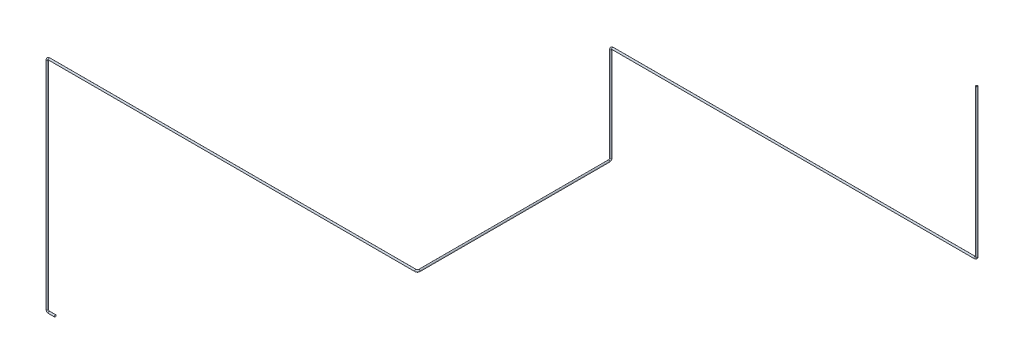
ISO-10303-21;
HEADER;
FILE_DESCRIPTION(('STEP AP214'),'2;1');
FILE_NAME('part.step','',(''),(''),'','','');
FILE_SCHEMA(('AUTOMOTIVE_DESIGN { 1 0 10303 214 1 1 1 1 }'));
ENDSEC;
DATA;
#1=APPLICATION_CONTEXT('core data for automotive mechanical design processes');
#2=APPLICATION_PROTOCOL_DEFINITION('international standard','automotive_design',2000,#1);
#3=PRODUCT_CONTEXT('',#1,'mechanical');
#4=PRODUCT('Part','Part','',(#3));
#5=PRODUCT_RELATED_PRODUCT_CATEGORY('part','',(#4));
#6=PRODUCT_DEFINITION_FORMATION('','',#4);
#7=PRODUCT_DEFINITION_CONTEXT('part definition',#1,'design');
#8=PRODUCT_DEFINITION('design','',#6,#7);
#9=PRODUCT_DEFINITION_SHAPE('','',#8);
#10=(LENGTH_UNIT() NAMED_UNIT(*) SI_UNIT(.MILLI.,.METRE.));
#11=(NAMED_UNIT(*) PLANE_ANGLE_UNIT() SI_UNIT($,.RADIAN.));
#12=(NAMED_UNIT(*) SI_UNIT($,.STERADIAN.) SOLID_ANGLE_UNIT());
#13=UNCERTAINTY_MEASURE_WITH_UNIT(LENGTH_MEASURE(1.E-05),#10,'distance_accuracy_value','');
#14=(GEOMETRIC_REPRESENTATION_CONTEXT(3) GLOBAL_UNCERTAINTY_ASSIGNED_CONTEXT((#13)) GLOBAL_UNIT_ASSIGNED_CONTEXT((#10,
#11,#12)) REPRESENTATION_CONTEXT('',''));
#15=CARTESIAN_POINT('',(0.,0.,0.));
#16=DIRECTION('',(0.,0.,1.));
#17=DIRECTION('',(1.,0.,0.));
#18=AXIS2_PLACEMENT_3D('',#15,#16,#17);
#19=CARTESIAN_POINT('',(-21783.3112637115,-6172.59943165804,38950.2492567144));
#20=DIRECTION('',(0.,1.,0.));
#21=DIRECTION('',(1.,0.,0.));
#22=AXIS2_PLACEMENT_3D('',#19,#20,#21);
#23=PLANE('',#22);
#24=CARTESIAN_POINT('',(-21783.3112637115,-6172.59943165804,38950.2492567144));
#25=DIRECTION('',(0.,1.,0.));
#26=DIRECTION('',(0.,0.,1.));
#27=AXIS2_PLACEMENT_3D('',#24,#25,#26);
#28=CIRCLE('',#27,14.0000000000006);
#29=CARTESIAN_POINT('',(-21783.3112637115,-6172.59943165804,38964.2492567144));
#30=VERTEX_POINT('',#29);
#31=EDGE_CURVE('E100',#30,#30,#28,.T.);
#32=ORIENTED_EDGE('',*,*,#31,.F.);
#33=EDGE_LOOP('',(#32));
#34=FACE_BOUND('',#33,.T.);
#35=CARTESIAN_POINT('',(-21783.3112637115,-6172.59943165804,38950.2492567144));
#36=DIRECTION('',(0.,1.,0.));
#37=DIRECTION('',(1.,0.,0.));
#38=AXIS2_PLACEMENT_3D('',#35,#36,#37);
#39=CIRCLE('',#38,15.0000000000006);
#40=CARTESIAN_POINT('',(-21768.3112637115,-6172.59943165804,38950.2492567144));
#41=VERTEX_POINT('',#40);
#42=EDGE_CURVE('E93',#41,#41,#39,.T.);
#43=ORIENTED_EDGE('',*,*,#42,.T.);
#44=EDGE_LOOP('',(#43));
#45=FACE_BOUND('',#44,.T.);
#46=ADVANCED_FACE('F47',(#34,#45),#23,.T.);
#47=CARTESIAN_POINT('',(-33723.2648506242,-13822.0136339342,42121.7001960568));
#48=DIRECTION('',(-1.,0.,0.));
#49=DIRECTION('',(0.,0.,1.));
#50=AXIS2_PLACEMENT_3D('',#47,#48,#49);
#51=PLANE('',#50);
#52=CARTESIAN_POINT('',(-33723.2648506242,-13822.0136339342,42121.7001960568));
#53=DIRECTION('',(-1.,0.,0.));
#54=DIRECTION('',(0.,0.,1.));
#55=AXIS2_PLACEMENT_3D('',#52,#53,#54);
#56=CIRCLE('',#55,14.0000000000006);
#57=CARTESIAN_POINT('',(-33723.2648506242,-13822.0136339342,42135.7001960568));
#58=VERTEX_POINT('',#57);
#59=EDGE_CURVE('E96',#58,#58,#56,.T.);
#60=ORIENTED_EDGE('',*,*,#59,.T.);
#61=EDGE_LOOP('',(#60));
#62=FACE_BOUND('',#61,.T.);
#63=CARTESIAN_POINT('',(-33723.2648506242,-13822.0136339342,42121.7001960568));
#64=DIRECTION('',(-1.,0.,0.));
#65=DIRECTION('',(0.,0.,1.));
#66=AXIS2_PLACEMENT_3D('',#63,#64,#65);
#67=CIRCLE('',#66,15.0000000000006);
#68=CARTESIAN_POINT('',(-33723.2648506242,-13822.0136339342,42136.7001960568));
#69=VERTEX_POINT('',#68);
#70=EDGE_CURVE('E11',#69,#69,#67,.T.);
#71=ORIENTED_EDGE('',*,*,#70,.F.);
#72=EDGE_LOOP('',(#71));
#73=FACE_BOUND('',#72,.T.);
#74=ADVANCED_FACE('F150',(#62,#73),#51,.F.);
#75=CARTESIAN_POINT('',(-21783.3112637115,-6172.59943165804,38950.2492567144));
#76=DIRECTION('',(0.,-1.,0.));
#77=DIRECTION('',(0.,0.,-1.));
#78=AXIS2_PLACEMENT_3D('',#75,#76,#77);
#79=CYLINDRICAL_SURFACE('',#78,15.0000000000006);
#80=CARTESIAN_POINT('',(-21783.3112637115,-8593.92082381698,38950.2492567144));
#81=DIRECTION('',(0.,1.,0.));
#82=DIRECTION('',(1.,0.,0.));
#83=AXIS2_PLACEMENT_3D('',#80,#81,#82);
#84=CIRCLE('',#83,15.0000000000006);
#85=CARTESIAN_POINT('',(-21768.3112637115,-8593.92082381698,38950.2492567144));
#86=VERTEX_POINT('',#85);
#87=EDGE_CURVE('E90',#86,#86,#84,.T.);
#88=ORIENTED_EDGE('',*,*,#87,.T.);
#89=EDGE_LOOP('',(#88));
#90=FACE_BOUND('',#89,.T.);
#91=ORIENTED_EDGE('',*,*,#42,.F.);
#92=EDGE_LOOP('',(#91));
#93=FACE_BOUND('',#92,.T.);
#94=ADVANCED_FACE('F154',(#90,#93),#79,.T.);
#95=CARTESIAN_POINT('',(-21813.3112637115,-8593.92082381698,38950.2492567144));
#96=DIRECTION('',(0.,0.,-1.));
#97=DIRECTION('',(-1.,0.,0.));
#98=AXIS2_PLACEMENT_3D('',#95,#96,#97);
#99=TOROIDAL_SURFACE('',#98,30.0000000000011,15.0000000000006);
#100=CARTESIAN_POINT('',(-21813.3112637115,-8623.92082381698,38950.2492567144));
#101=DIRECTION('',(1.,0.,0.));
#102=DIRECTION('',(0.,-1.,0.));
#103=AXIS2_PLACEMENT_3D('',#100,#101,#102);
#104=CIRCLE('',#103,15.0000000000006);
#105=CARTESIAN_POINT('',(-21813.3112637115,-8638.92082381698,38950.2492567144));
#106=VERTEX_POINT('',#105);
#107=EDGE_CURVE('E87',#106,#106,#104,.T.);
#108=CARTESIAN_POINT('',(-21813.3112637115,-8593.92082381698,38950.2492567144));
#109=DIRECTION('',(0.,0.,-1.));
#110=DIRECTION('',(-1.,0.,0.));
#111=AXIS2_PLACEMENT_3D('',#108,#109,#110);
#112=CIRCLE('',#111,45.0000000000017);
#113=EDGE_CURVE('',#86,#106,#112,.T.);
#114=ORIENTED_EDGE('',*,*,#87,.F.);
#115=ORIENTED_EDGE('',*,*,#107,.T.);
#116=ORIENTED_EDGE('',*,*,#113,.T.);
#117=ORIENTED_EDGE('',*,*,#113,.F.);
#118=EDGE_LOOP('',(#114,#116,#115,#117));
#119=FACE_BOUND('',#118,.T.);
#120=ADVANCED_FACE('F156',(#119),#99,.T.);
#121=CARTESIAN_POINT('',(-21813.3112637115,-8623.92082381698,38950.2492567144));
#122=DIRECTION('',(-1.,0.,0.));
#123=DIRECTION('',(0.,0.,1.));
#124=AXIS2_PLACEMENT_3D('',#121,#122,#123);
#125=CYLINDRICAL_SURFACE('',#124,15.0000000000006);
#126=CARTESIAN_POINT('',(-27753.5298397896,-8623.92082381698,38950.2492567144));
#127=DIRECTION('',(1.,0.,0.));
#128=DIRECTION('',(0.,-1.,0.));
#129=AXIS2_PLACEMENT_3D('',#126,#127,#128);
#130=CIRCLE('',#129,15.0000000000006);
#131=CARTESIAN_POINT('',(-27753.5298397896,-8608.92082381698,38950.2492567144));
#132=VERTEX_POINT('',#131);
#133=EDGE_CURVE('E84',#132,#132,#130,.T.);
#134=ORIENTED_EDGE('',*,*,#133,.T.);
#135=EDGE_LOOP('',(#134));
#136=FACE_BOUND('',#135,.T.);
#137=ORIENTED_EDGE('',*,*,#107,.F.);
#138=EDGE_LOOP('',(#137));
#139=FACE_BOUND('',#138,.T.);
#140=ADVANCED_FACE('F163',(#136,#139),#125,.T.);
#141=CARTESIAN_POINT('',(-27753.5298397896,-8653.92082381698,38950.2492567144));
#142=DIRECTION('',(0.,0.,1.));
#143=DIRECTION('',(1.,0.,0.));
#144=AXIS2_PLACEMENT_3D('',#141,#142,#143);
#145=TOROIDAL_SURFACE('',#144,29.9999999999958,15.0000000000006);
#146=CARTESIAN_POINT('',(-27783.5298397896,-8653.92082381697,38950.2492567144));
#147=DIRECTION('',(0.,1.,0.));
#148=DIRECTION('',(1.,0.,0.));
#149=AXIS2_PLACEMENT_3D('',#146,#147,#148);
#150=CIRCLE('',#149,15.0000000000006);
#151=CARTESIAN_POINT('',(-27798.5298397896,-8653.92082381697,38950.2492567144));
#152=VERTEX_POINT('',#151);
#153=EDGE_CURVE('E81',#152,#152,#150,.T.);
#154=CARTESIAN_POINT('',(-27753.5298397896,-8653.92082381698,38950.2492567144));
#155=DIRECTION('',(0.,0.,1.));
#156=DIRECTION('',(1.,0.,0.));
#157=AXIS2_PLACEMENT_3D('',#154,#155,#156);
#158=CIRCLE('',#157,44.9999999999964);
#159=EDGE_CURVE('',#132,#152,#158,.T.);
#160=ORIENTED_EDGE('',*,*,#133,.F.);
#161=ORIENTED_EDGE('',*,*,#153,.T.);
#162=ORIENTED_EDGE('',*,*,#159,.T.);
#163=ORIENTED_EDGE('',*,*,#159,.F.);
#164=EDGE_LOOP('',(#160,#162,#161,#163));
#165=FACE_BOUND('',#164,.T.);
#166=ADVANCED_FACE('F204',(#165),#145,.T.);
#167=CARTESIAN_POINT('',(-27783.5298397896,-8653.92082381697,38950.2492567144));
#168=DIRECTION('',(0.,-1.,0.));
#169=DIRECTION('',(0.,0.,-1.));
#170=AXIS2_PLACEMENT_3D('',#167,#168,#169);
#171=CYLINDRICAL_SURFACE('',#170,15.0000000000006);
#172=CARTESIAN_POINT('',(-27783.5298397896,-10192.4379230615,38950.2492567144));
#173=DIRECTION('',(0.,1.,0.));
#174=DIRECTION('',(1.,0.,0.));
#175=AXIS2_PLACEMENT_3D('',#172,#173,#174);
#176=CIRCLE('',#175,15.0000000000006);
#177=CARTESIAN_POINT('',(-27783.5298397896,-10192.4379230615,38935.2492567144));
#178=VERTEX_POINT('',#177);
#179=EDGE_CURVE('E78',#178,#178,#176,.T.);
#180=ORIENTED_EDGE('',*,*,#179,.T.);
#181=EDGE_LOOP('',(#180));
#182=FACE_BOUND('',#181,.T.);
#183=ORIENTED_EDGE('',*,*,#153,.F.);
#184=EDGE_LOOP('',(#183));
#185=FACE_BOUND('',#184,.T.);
#186=ADVANCED_FACE('F200',(#182,#185),#171,.T.);
#187=CARTESIAN_POINT('',(-27783.5298397896,-10192.4379230615,38980.2492567144));
#188=DIRECTION('',(-1.,0.,0.));
#189=DIRECTION('',(0.,0.,1.));
#190=AXIS2_PLACEMENT_3D('',#187,#188,#189);
#191=TOROIDAL_SURFACE('',#190,30.0000000000011,15.0000000000006);
#192=CARTESIAN_POINT('',(-27783.5298397896,-10222.4379230615,38980.2492567144));
#193=DIRECTION('',(0.,0.,-1.));
#194=DIRECTION('',(1.,0.,0.));
#195=AXIS2_PLACEMENT_3D('',#192,#193,#194);
#196=CIRCLE('',#195,15.0000000000006);
#197=CARTESIAN_POINT('',(-27783.5298397896,-10237.4379230615,38980.2492567144));
#198=VERTEX_POINT('',#197);
#199=EDGE_CURVE('E75',#198,#198,#196,.T.);
#200=CARTESIAN_POINT('',(-27783.5298397896,-10192.4379230615,38980.2492567144));
#201=DIRECTION('',(-1.,0.,0.));
#202=DIRECTION('',(0.,0.,1.));
#203=AXIS2_PLACEMENT_3D('',#200,#201,#202);
#204=CIRCLE('',#203,45.0000000000017);
#205=EDGE_CURVE('',#178,#198,#204,.T.);
#206=ORIENTED_EDGE('',*,*,#179,.F.);
#207=ORIENTED_EDGE('',*,*,#199,.T.);
#208=ORIENTED_EDGE('',*,*,#205,.T.);
#209=ORIENTED_EDGE('',*,*,#205,.F.);
#210=EDGE_LOOP('',(#206,#208,#207,#209));
#211=FACE_BOUND('',#210,.T.);
#212=ADVANCED_FACE('F196',(#211),#191,.T.);
#213=CARTESIAN_POINT('',(-27783.5298397896,-10222.4379230615,38980.2492567144));
#214=DIRECTION('',(0.,0.,1.));
#215=DIRECTION('',(1.,0.,0.));
#216=AXIS2_PLACEMENT_3D('',#213,#214,#215);
#217=CYLINDRICAL_SURFACE('',#216,15.0000000000006);
#218=CARTESIAN_POINT('',(-27783.5298397896,-10222.4379230615,42091.7001960568));
#219=DIRECTION('',(0.,0.,-1.));
#220=DIRECTION('',(1.,0.,0.));
#221=AXIS2_PLACEMENT_3D('',#218,#219,#220);
#222=CIRCLE('',#221,15.0000000000006);
#223=CARTESIAN_POINT('',(-27768.5298397896,-10222.4379230615,42091.7001960568));
#224=VERTEX_POINT('',#223);
#225=EDGE_CURVE('E72',#224,#224,#222,.T.);
#226=ORIENTED_EDGE('',*,*,#225,.T.);
#227=EDGE_LOOP('',(#226));
#228=FACE_BOUND('',#227,.T.);
#229=ORIENTED_EDGE('',*,*,#199,.F.);
#230=EDGE_LOOP('',(#229));
#231=FACE_BOUND('',#230,.T.);
#232=ADVANCED_FACE('F192',(#228,#231),#217,.T.);
#233=CARTESIAN_POINT('',(-27813.5298397896,-10222.4379230615,42091.7001960568));
#234=DIRECTION('',(0.,-1.,0.));
#235=DIRECTION('',(0.,0.,-1.));
#236=AXIS2_PLACEMENT_3D('',#233,#234,#235);
#237=TOROIDAL_SURFACE('',#236,30.0000000000082,15.0000000000006);
#238=CARTESIAN_POINT('',(-27813.5298397896,-10222.4379230615,42121.7001960569));
#239=DIRECTION('',(1.,0.,0.));
#240=DIRECTION('',(0.,0.,1.));
#241=AXIS2_PLACEMENT_3D('',#238,#239,#240);
#242=CIRCLE('',#241,15.0000000000006);
#243=CARTESIAN_POINT('',(-27813.5298397896,-10222.4379230615,42136.7001960569));
#244=VERTEX_POINT('',#243);
#245=EDGE_CURVE('E69',#244,#244,#242,.T.);
#246=CARTESIAN_POINT('',(-27813.5298397896,-10222.4379230615,42091.7001960568));
#247=DIRECTION('',(0.,-1.,0.));
#248=DIRECTION('',(0.,0.,-1.));
#249=AXIS2_PLACEMENT_3D('',#246,#247,#248);
#250=CIRCLE('',#249,45.0000000000088);
#251=EDGE_CURVE('',#224,#244,#250,.T.);
#252=ORIENTED_EDGE('',*,*,#225,.F.);
#253=ORIENTED_EDGE('',*,*,#245,.T.);
#254=ORIENTED_EDGE('',*,*,#251,.T.);
#255=ORIENTED_EDGE('',*,*,#251,.F.);
#256=EDGE_LOOP('',(#252,#254,#253,#255));
#257=FACE_BOUND('',#256,.T.);
#258=ADVANCED_FACE('F188',(#257),#237,.T.);
#259=CARTESIAN_POINT('',(-27813.5298397896,-10222.4379230615,42121.7001960569));
#260=DIRECTION('',(-1.,0.,0.));
#261=DIRECTION('',(0.,-1.,0.));
#262=AXIS2_PLACEMENT_3D('',#259,#260,#261);
#263=CYLINDRICAL_SURFACE('',#262,15.0000000000006);
#264=CARTESIAN_POINT('',(-33823.2648506242,-10222.4379230615,42121.7001960569));
#265=DIRECTION('',(1.,0.,0.));
#266=DIRECTION('',(0.,0.,1.));
#267=AXIS2_PLACEMENT_3D('',#264,#265,#266);
#268=CIRCLE('',#267,15.0000000000006);
#269=CARTESIAN_POINT('',(-33823.2648506242,-10207.4379230615,42121.7001960569));
#270=VERTEX_POINT('',#269);
#271=EDGE_CURVE('E66',#270,#270,#268,.T.);
#272=ORIENTED_EDGE('',*,*,#271,.T.);
#273=EDGE_LOOP('',(#272));
#274=FACE_BOUND('',#273,.T.);
#275=ORIENTED_EDGE('',*,*,#245,.F.);
#276=EDGE_LOOP('',(#275));
#277=FACE_BOUND('',#276,.T.);
#278=ADVANCED_FACE('F184',(#274,#277),#263,.T.);
#279=CARTESIAN_POINT('',(-33823.2648506242,-10252.4379230615,42121.7001960568));
#280=DIRECTION('',(0.,0.,1.));
#281=DIRECTION('',(1.,0.,0.));
#282=AXIS2_PLACEMENT_3D('',#279,#280,#281);
#283=TOROIDAL_SURFACE('',#282,29.9999999999994,15.0000000000006);
#284=CARTESIAN_POINT('',(-33853.2648506242,-10252.4379230615,42121.7001960568));
#285=DIRECTION('',(0.,1.,0.));
#286=DIRECTION('',(0.,0.,1.));
#287=AXIS2_PLACEMENT_3D('',#284,#285,#286);
#288=CIRCLE('',#287,15.0000000000006);
#289=CARTESIAN_POINT('',(-33868.2648506242,-10252.4379230615,42121.7001960568));
#290=VERTEX_POINT('',#289);
#291=EDGE_CURVE('E61',#290,#290,#288,.T.);
#292=CARTESIAN_POINT('',(-33823.2648506242,-10252.4379230615,42121.7001960568));
#293=DIRECTION('',(0.,0.,1.));
#294=DIRECTION('',(1.,0.,0.));
#295=AXIS2_PLACEMENT_3D('',#292,#293,#294);
#296=CIRCLE('',#295,44.9999999999999);
#297=EDGE_CURVE('',#270,#290,#296,.T.);
#298=ORIENTED_EDGE('',*,*,#271,.F.);
#299=ORIENTED_EDGE('',*,*,#291,.T.);
#300=ORIENTED_EDGE('',*,*,#297,.T.);
#301=ORIENTED_EDGE('',*,*,#297,.F.);
#302=EDGE_LOOP('',(#298,#300,#299,#301));
#303=FACE_BOUND('',#302,.T.);
#304=ADVANCED_FACE('F180',(#303),#283,.T.);
#305=CARTESIAN_POINT('',(-33853.2648506242,-10252.4379230615,42121.7001960568));
#306=DIRECTION('',(0.,-1.,0.));
#307=DIRECTION('',(0.,0.,-1.));
#308=AXIS2_PLACEMENT_3D('',#305,#306,#307);
#309=CYLINDRICAL_SURFACE('',#308,15.0000000000006);
#310=CARTESIAN_POINT('',(-33853.2648506242,-13792.0136339342,42121.7001960569));
#311=DIRECTION('',(0.,1.,0.));
#312=DIRECTION('',(0.,0.,1.));
#313=AXIS2_PLACEMENT_3D('',#310,#311,#312);
#314=CIRCLE('',#313,15.0000000000006);
#315=CARTESIAN_POINT('',(-33868.2648506242,-13792.0136339342,42121.7001960569));
#316=VERTEX_POINT('',#315);
#317=EDGE_CURVE('E57',#316,#316,#314,.T.);
#318=ORIENTED_EDGE('',*,*,#317,.T.);
#319=EDGE_LOOP('',(#318));
#320=FACE_BOUND('',#319,.T.);
#321=ORIENTED_EDGE('',*,*,#291,.F.);
#322=EDGE_LOOP('',(#321));
#323=FACE_BOUND('',#322,.T.);
#324=ADVANCED_FACE('F174',(#320,#323),#309,.T.);
#325=CARTESIAN_POINT('',(-33823.2648506242,-13792.0136339342,42121.7001960568));
#326=DIRECTION('',(0.,0.,1.));
#327=DIRECTION('',(1.,0.,0.));
#328=AXIS2_PLACEMENT_3D('',#325,#326,#327);
#329=TOROIDAL_SURFACE('',#328,30.0000000000011,15.0000000000006);
#330=CARTESIAN_POINT('',(-33823.2648506242,-13822.0136339342,42121.7001960568));
#331=DIRECTION('',(-1.,0.,0.));
#332=DIRECTION('',(0.,0.,1.));
#333=AXIS2_PLACEMENT_3D('',#330,#331,#332);
#334=CIRCLE('',#333,15.0000000000006);
#335=CARTESIAN_POINT('',(-33823.2648506242,-13837.0136339342,42121.7001960568));
#336=VERTEX_POINT('',#335);
#337=EDGE_CURVE('E53',#336,#336,#334,.T.);
#338=CARTESIAN_POINT('',(-33823.2648506242,-13792.0136339342,42121.7001960568));
#339=DIRECTION('',(0.,0.,1.));
#340=DIRECTION('',(1.,0.,0.));
#341=AXIS2_PLACEMENT_3D('',#338,#339,#340);
#342=CIRCLE('',#341,45.0000000000017);
#343=EDGE_CURVE('',#316,#336,#342,.T.);
#344=ORIENTED_EDGE('',*,*,#317,.F.);
#345=ORIENTED_EDGE('',*,*,#337,.T.);
#346=ORIENTED_EDGE('',*,*,#343,.T.);
#347=ORIENTED_EDGE('',*,*,#343,.F.);
#348=EDGE_LOOP('',(#344,#346,#345,#347));
#349=FACE_BOUND('',#348,.T.);
#350=ADVANCED_FACE('F169',(#349),#329,.T.);
#351=CARTESIAN_POINT('',(-33823.2648506242,-13822.0136339342,42121.7001960568));
#352=DIRECTION('',(1.,0.,0.));
#353=DIRECTION('',(0.,0.,-1.));
#354=AXIS2_PLACEMENT_3D('',#351,#352,#353);
#355=CYLINDRICAL_SURFACE('',#354,15.0000000000006);
#356=ORIENTED_EDGE('',*,*,#70,.T.);
#357=EDGE_LOOP('',(#356));
#358=FACE_BOUND('',#357,.T.);
#359=ORIENTED_EDGE('',*,*,#337,.F.);
#360=EDGE_LOOP('',(#359));
#361=FACE_BOUND('',#360,.T.);
#362=ADVANCED_FACE('F144',(#358,#361),#355,.T.);
#363=CARTESIAN_POINT('',(-21783.3112637115,-6172.59943165804,38950.2492567144));
#364=DIRECTION('',(0.,-1.,0.));
#365=DIRECTION('',(0.,0.,-1.));
#366=AXIS2_PLACEMENT_3D('',#363,#364,#365);
#367=CYLINDRICAL_SURFACE('',#366,14.0000000000006);
#368=CARTESIAN_POINT('',(-21783.3112637115,-8593.92082381698,38950.2492567144));
#369=DIRECTION('',(0.,-1.,0.));
#370=DIRECTION('',(0.,0.,-1.));
#371=AXIS2_PLACEMENT_3D('',#368,#369,#370);
#372=CIRCLE('',#371,14.0000000000006);
#373=CARTESIAN_POINT('',(-21769.3112637115,-8593.92082381698,38950.2492567144));
#374=VERTEX_POINT('',#373);
#375=EDGE_CURVE('E103',#374,#374,#372,.F.);
#376=ORIENTED_EDGE('',*,*,#375,.F.);
#377=EDGE_LOOP('',(#376));
#378=FACE_BOUND('',#377,.T.);
#379=ORIENTED_EDGE('',*,*,#31,.T.);
#380=EDGE_LOOP('',(#379));
#381=FACE_BOUND('',#380,.T.);
#382=ADVANCED_FACE('F141',(#378,#381),#367,.F.);
#383=CARTESIAN_POINT('',(-21813.3112637115,-8593.92082381698,38950.2492567144));
#384=DIRECTION('',(0.,0.,-1.));
#385=DIRECTION('',(-1.,0.,0.));
#386=AXIS2_PLACEMENT_3D('',#383,#384,#385);
#387=TOROIDAL_SURFACE('',#386,30.0000000000011,14.0000000000006);
#388=CARTESIAN_POINT('',(-21813.3112637115,-8623.92082381698,38950.2492567144));
#389=DIRECTION('',(1.,0.,0.));
#390=DIRECTION('',(0.,1.,0.));
#391=AXIS2_PLACEMENT_3D('',#388,#389,#390);
#392=CIRCLE('',#391,14.0000000000006);
#393=CARTESIAN_POINT('',(-21813.3112637115,-8637.92082381698,38950.2492567144));
#394=VERTEX_POINT('',#393);
#395=EDGE_CURVE('E133',#394,#394,#392,.T.);
#396=CARTESIAN_POINT('',(-21813.3112637115,-8593.92082381698,38950.2492567144));
#397=DIRECTION('',(0.,0.,-1.));
#398=DIRECTION('',(-1.,0.,0.));
#399=AXIS2_PLACEMENT_3D('',#396,#397,#398);
#400=CIRCLE('',#399,44.0000000000017);
#401=EDGE_CURVE('',#374,#394,#400,.T.);
#402=ORIENTED_EDGE('',*,*,#375,.T.);
#403=ORIENTED_EDGE('',*,*,#395,.F.);
#404=ORIENTED_EDGE('',*,*,#401,.T.);
#405=ORIENTED_EDGE('',*,*,#401,.F.);
#406=EDGE_LOOP('',(#402,#404,#403,#405));
#407=FACE_BOUND('',#406,.T.);
#408=ADVANCED_FACE('F139',(#407),#387,.F.);
#409=CARTESIAN_POINT('',(-21813.3112637115,-8623.92082381698,38950.2492567144));
#410=DIRECTION('',(-1.,0.,0.));
#411=DIRECTION('',(0.,0.,1.));
#412=AXIS2_PLACEMENT_3D('',#409,#410,#411);
#413=CYLINDRICAL_SURFACE('',#412,14.0000000000006);
#414=CARTESIAN_POINT('',(-27753.5298397896,-8623.92082381698,38950.2492567144));
#415=DIRECTION('',(-1.,0.,0.));
#416=DIRECTION('',(0.,0.,1.));
#417=AXIS2_PLACEMENT_3D('',#414,#415,#416);
#418=CIRCLE('',#417,14.0000000000006);
#419=CARTESIAN_POINT('',(-27753.5298397896,-8609.92082381698,38950.2492567144));
#420=VERTEX_POINT('',#419);
#421=EDGE_CURVE('E130',#420,#420,#418,.F.);
#422=ORIENTED_EDGE('',*,*,#421,.F.);
#423=EDGE_LOOP('',(#422));
#424=FACE_BOUND('',#423,.T.);
#425=ORIENTED_EDGE('',*,*,#395,.T.);
#426=EDGE_LOOP('',(#425));
#427=FACE_BOUND('',#426,.T.);
#428=ADVANCED_FACE('F279',(#424,#427),#413,.F.);
#429=CARTESIAN_POINT('',(-27753.5298397896,-8653.92082381698,38950.2492567144));
#430=DIRECTION('',(0.,0.,1.));
#431=DIRECTION('',(1.,0.,0.));
#432=AXIS2_PLACEMENT_3D('',#429,#430,#431);
#433=TOROIDAL_SURFACE('',#432,29.9999999999958,14.0000000000006);
#434=CARTESIAN_POINT('',(-27783.5298397896,-8653.92082381697,38950.2492567144));
#435=DIRECTION('',(0.,1.,0.));
#436=DIRECTION('',(-1.,0.,0.));
#437=AXIS2_PLACEMENT_3D('',#434,#435,#436);
#438=CIRCLE('',#437,14.0000000000006);
#439=CARTESIAN_POINT('',(-27797.5298397896,-8653.92082381697,38950.2492567144));
#440=VERTEX_POINT('',#439);
#441=EDGE_CURVE('E127',#440,#440,#438,.T.);
#442=CARTESIAN_POINT('',(-27753.5298397896,-8653.92082381698,38950.2492567144));
#443=DIRECTION('',(0.,0.,1.));
#444=DIRECTION('',(1.,0.,0.));
#445=AXIS2_PLACEMENT_3D('',#442,#443,#444);
#446=CIRCLE('',#445,43.9999999999964);
#447=EDGE_CURVE('',#420,#440,#446,.T.);
#448=ORIENTED_EDGE('',*,*,#421,.T.);
#449=ORIENTED_EDGE('',*,*,#441,.F.);
#450=ORIENTED_EDGE('',*,*,#447,.T.);
#451=ORIENTED_EDGE('',*,*,#447,.F.);
#452=EDGE_LOOP('',(#448,#450,#449,#451));
#453=FACE_BOUND('',#452,.T.);
#454=ADVANCED_FACE('F290',(#453),#433,.F.);
#455=CARTESIAN_POINT('',(-27783.5298397896,-8653.92082381697,38950.2492567144));
#456=DIRECTION('',(0.,-1.,0.));
#457=DIRECTION('',(0.,0.,-1.));
#458=AXIS2_PLACEMENT_3D('',#455,#456,#457);
#459=CYLINDRICAL_SURFACE('',#458,14.0000000000006);
#460=CARTESIAN_POINT('',(-27783.5298397896,-10192.4379230615,38950.2492567144));
#461=DIRECTION('',(0.,-1.,0.));
#462=DIRECTION('',(0.,0.,-1.));
#463=AXIS2_PLACEMENT_3D('',#460,#461,#462);
#464=CIRCLE('',#463,14.0000000000006);
#465=CARTESIAN_POINT('',(-27783.5298397896,-10192.4379230615,38936.2492567144));
#466=VERTEX_POINT('',#465);
#467=EDGE_CURVE('E124',#466,#466,#464,.F.);
#468=ORIENTED_EDGE('',*,*,#467,.F.);
#469=EDGE_LOOP('',(#468));
#470=FACE_BOUND('',#469,.T.);
#471=ORIENTED_EDGE('',*,*,#441,.T.);
#472=EDGE_LOOP('',(#471));
#473=FACE_BOUND('',#472,.T.);
#474=ADVANCED_FACE('F301',(#470,#473),#459,.F.);
#475=CARTESIAN_POINT('',(-27783.5298397896,-10192.4379230615,38980.2492567144));
#476=DIRECTION('',(-1.,0.,0.));
#477=DIRECTION('',(0.,0.,1.));
#478=AXIS2_PLACEMENT_3D('',#475,#476,#477);
#479=TOROIDAL_SURFACE('',#478,30.0000000000011,14.0000000000006);
#480=CARTESIAN_POINT('',(-27783.5298397896,-10222.4379230615,38980.2492567144));
#481=DIRECTION('',(0.,0.,-1.));
#482=DIRECTION('',(0.,1.,0.));
#483=AXIS2_PLACEMENT_3D('',#480,#481,#482);
#484=CIRCLE('',#483,14.0000000000006);
#485=CARTESIAN_POINT('',(-27783.5298397896,-10236.4379230615,38980.2492567144));
#486=VERTEX_POINT('',#485);
#487=EDGE_CURVE('E121',#486,#486,#484,.T.);
#488=CARTESIAN_POINT('',(-27783.5298397896,-10192.4379230615,38980.2492567144));
#489=DIRECTION('',(-1.,0.,0.));
#490=DIRECTION('',(0.,0.,1.));
#491=AXIS2_PLACEMENT_3D('',#488,#489,#490);
#492=CIRCLE('',#491,44.0000000000017);
#493=EDGE_CURVE('',#466,#486,#492,.T.);
#494=ORIENTED_EDGE('',*,*,#467,.T.);
#495=ORIENTED_EDGE('',*,*,#487,.F.);
#496=ORIENTED_EDGE('',*,*,#493,.T.);
#497=ORIENTED_EDGE('',*,*,#493,.F.);
#498=EDGE_LOOP('',(#494,#496,#495,#497));
#499=FACE_BOUND('',#498,.T.);
#500=ADVANCED_FACE('F312',(#499),#479,.F.);
#501=CARTESIAN_POINT('',(-27783.5298397896,-10222.4379230615,38980.2492567144));
#502=DIRECTION('',(0.,0.,1.));
#503=DIRECTION('',(1.,0.,0.));
#504=AXIS2_PLACEMENT_3D('',#501,#502,#503);
#505=CYLINDRICAL_SURFACE('',#504,14.0000000000006);
#506=CARTESIAN_POINT('',(-27783.5298397896,-10222.4379230615,42091.7001960568));
#507=DIRECTION('',(0.,0.,1.));
#508=DIRECTION('',(1.,0.,0.));
#509=AXIS2_PLACEMENT_3D('',#506,#507,#508);
#510=CIRCLE('',#509,14.0000000000006);
#511=CARTESIAN_POINT('',(-27769.5298397896,-10222.4379230615,42091.7001960568));
#512=VERTEX_POINT('',#511);
#513=EDGE_CURVE('E118',#512,#512,#510,.F.);
#514=ORIENTED_EDGE('',*,*,#513,.F.);
#515=EDGE_LOOP('',(#514));
#516=FACE_BOUND('',#515,.T.);
#517=ORIENTED_EDGE('',*,*,#487,.T.);
#518=EDGE_LOOP('',(#517));
#519=FACE_BOUND('',#518,.T.);
#520=ADVANCED_FACE('F323',(#516,#519),#505,.F.);
#521=CARTESIAN_POINT('',(-27813.5298397896,-10222.4379230615,42091.7001960568));
#522=DIRECTION('',(0.,-1.,0.));
#523=DIRECTION('',(0.,0.,-1.));
#524=AXIS2_PLACEMENT_3D('',#521,#522,#523);
#525=TOROIDAL_SURFACE('',#524,30.0000000000082,14.0000000000006);
#526=CARTESIAN_POINT('',(-27813.5298397896,-10222.4379230615,42121.7001960569));
#527=DIRECTION('',(1.,0.,0.));
#528=DIRECTION('',(0.,0.,-1.));
#529=AXIS2_PLACEMENT_3D('',#526,#527,#528);
#530=CIRCLE('',#529,14.0000000000006);
#531=CARTESIAN_POINT('',(-27813.5298397896,-10222.4379230615,42135.7001960569));
#532=VERTEX_POINT('',#531);
#533=EDGE_CURVE('E115',#532,#532,#530,.T.);
#534=CARTESIAN_POINT('',(-27813.5298397896,-10222.4379230615,42091.7001960568));
#535=DIRECTION('',(0.,-1.,0.));
#536=DIRECTION('',(0.,0.,-1.));
#537=AXIS2_PLACEMENT_3D('',#534,#535,#536);
#538=CIRCLE('',#537,44.0000000000088);
#539=EDGE_CURVE('',#512,#532,#538,.T.);
#540=ORIENTED_EDGE('',*,*,#513,.T.);
#541=ORIENTED_EDGE('',*,*,#533,.F.);
#542=ORIENTED_EDGE('',*,*,#539,.T.);
#543=ORIENTED_EDGE('',*,*,#539,.F.);
#544=EDGE_LOOP('',(#540,#542,#541,#543));
#545=FACE_BOUND('',#544,.T.);
#546=ADVANCED_FACE('F334',(#545),#525,.F.);
#547=CARTESIAN_POINT('',(-27813.5298397896,-10222.4379230615,42121.7001960569));
#548=DIRECTION('',(-1.,0.,0.));
#549=DIRECTION('',(0.,-1.,0.));
#550=AXIS2_PLACEMENT_3D('',#547,#548,#549);
#551=CYLINDRICAL_SURFACE('',#550,14.0000000000006);
#552=CARTESIAN_POINT('',(-33823.2648506242,-10222.4379230615,42121.7001960569));
#553=DIRECTION('',(-1.,0.,0.));
#554=DIRECTION('',(0.,-1.,0.));
#555=AXIS2_PLACEMENT_3D('',#552,#553,#554);
#556=CIRCLE('',#555,14.0000000000006);
#557=CARTESIAN_POINT('',(-33823.2648506242,-10208.4379230615,42121.7001960569));
#558=VERTEX_POINT('',#557);
#559=EDGE_CURVE('E112',#558,#558,#556,.F.);
#560=ORIENTED_EDGE('',*,*,#559,.F.);
#561=EDGE_LOOP('',(#560));
#562=FACE_BOUND('',#561,.T.);
#563=ORIENTED_EDGE('',*,*,#533,.T.);
#564=EDGE_LOOP('',(#563));
#565=FACE_BOUND('',#564,.T.);
#566=ADVANCED_FACE('F345',(#562,#565),#551,.F.);
#567=CARTESIAN_POINT('',(-33823.2648506242,-10252.4379230615,42121.7001960568));
#568=DIRECTION('',(0.,0.,1.));
#569=DIRECTION('',(1.,0.,0.));
#570=AXIS2_PLACEMENT_3D('',#567,#568,#569);
#571=TOROIDAL_SURFACE('',#570,29.9999999999994,14.0000000000006);
#572=CARTESIAN_POINT('',(-33853.2648506242,-10252.4379230615,42121.7001960568));
#573=DIRECTION('',(0.,1.,0.));
#574=DIRECTION('',(-1.,0.,0.));
#575=AXIS2_PLACEMENT_3D('',#572,#573,#574);
#576=CIRCLE('',#575,14.0000000000006);
#577=CARTESIAN_POINT('',(-33867.2648506242,-10252.4379230615,42121.7001960568));
#578=VERTEX_POINT('',#577);
#579=EDGE_CURVE('E109',#578,#578,#576,.T.);
#580=CARTESIAN_POINT('',(-33823.2648506242,-10252.4379230615,42121.7001960568));
#581=DIRECTION('',(0.,0.,1.));
#582=DIRECTION('',(1.,0.,0.));
#583=AXIS2_PLACEMENT_3D('',#580,#581,#582);
#584=CIRCLE('',#583,43.9999999999999);
#585=EDGE_CURVE('',#558,#578,#584,.T.);
#586=ORIENTED_EDGE('',*,*,#559,.T.);
#587=ORIENTED_EDGE('',*,*,#579,.F.);
#588=ORIENTED_EDGE('',*,*,#585,.T.);
#589=ORIENTED_EDGE('',*,*,#585,.F.);
#590=EDGE_LOOP('',(#586,#588,#587,#589));
#591=FACE_BOUND('',#590,.T.);
#592=ADVANCED_FACE('F356',(#591),#571,.F.);
#593=CARTESIAN_POINT('',(-33853.2648506242,-10252.4379230615,42121.7001960568));
#594=DIRECTION('',(0.,-1.,0.));
#595=DIRECTION('',(0.,0.,-1.));
#596=AXIS2_PLACEMENT_3D('',#593,#594,#595);
#597=CYLINDRICAL_SURFACE('',#596,14.0000000000006);
#598=CARTESIAN_POINT('',(-33853.2648506242,-13792.0136339342,42121.7001960569));
#599=DIRECTION('',(0.,-1.,0.));
#600=DIRECTION('',(0.,0.,-1.));
#601=AXIS2_PLACEMENT_3D('',#598,#599,#600);
#602=CIRCLE('',#601,14.0000000000006);
#603=CARTESIAN_POINT('',(-33867.2648506242,-13792.0136339342,42121.7001960569));
#604=VERTEX_POINT('',#603);
#605=EDGE_CURVE('E106',#604,#604,#602,.F.);
#606=ORIENTED_EDGE('',*,*,#605,.F.);
#607=EDGE_LOOP('',(#606));
#608=FACE_BOUND('',#607,.T.);
#609=ORIENTED_EDGE('',*,*,#579,.T.);
#610=EDGE_LOOP('',(#609));
#611=FACE_BOUND('',#610,.T.);
#612=ADVANCED_FACE('F367',(#608,#611),#597,.F.);
#613=CARTESIAN_POINT('',(-33823.2648506242,-13792.0136339342,42121.7001960568));
#614=DIRECTION('',(0.,0.,1.));
#615=DIRECTION('',(1.,0.,0.));
#616=AXIS2_PLACEMENT_3D('',#613,#614,#615);
#617=TOROIDAL_SURFACE('',#616,30.0000000000011,14.0000000000006);
#618=CARTESIAN_POINT('',(-33823.2648506242,-13822.0136339342,42121.7001960568));
#619=DIRECTION('',(-1.,0.,0.));
#620=DIRECTION('',(0.,-1.,0.));
#621=AXIS2_PLACEMENT_3D('',#618,#619,#620);
#622=CIRCLE('',#621,14.0000000000006);
#623=CARTESIAN_POINT('',(-33823.2648506242,-13836.0136339342,42121.7001960568));
#624=VERTEX_POINT('',#623);
#625=EDGE_CURVE('E99',#624,#624,#622,.T.);
#626=CARTESIAN_POINT('',(-33823.2648506242,-13792.0136339342,42121.7001960568));
#627=DIRECTION('',(0.,0.,1.));
#628=DIRECTION('',(1.,0.,0.));
#629=AXIS2_PLACEMENT_3D('',#626,#627,#628);
#630=CIRCLE('',#629,44.0000000000017);
#631=EDGE_CURVE('',#604,#624,#630,.T.);
#632=ORIENTED_EDGE('',*,*,#605,.T.);
#633=ORIENTED_EDGE('',*,*,#625,.F.);
#634=ORIENTED_EDGE('',*,*,#631,.T.);
#635=ORIENTED_EDGE('',*,*,#631,.F.);
#636=EDGE_LOOP('',(#632,#634,#633,#635));
#637=FACE_BOUND('',#636,.T.);
#638=ADVANCED_FACE('F378',(#637),#617,.F.);
#639=CARTESIAN_POINT('',(-33823.2648506242,-13822.0136339342,42121.7001960568));
#640=DIRECTION('',(1.,0.,0.));
#641=DIRECTION('',(0.,0.,-1.));
#642=AXIS2_PLACEMENT_3D('',#639,#640,#641);
#643=CYLINDRICAL_SURFACE('',#642,14.0000000000006);
#644=ORIENTED_EDGE('',*,*,#59,.F.);
#645=EDGE_LOOP('',(#644));
#646=FACE_BOUND('',#645,.T.);
#647=ORIENTED_EDGE('',*,*,#625,.T.);
#648=EDGE_LOOP('',(#647));
#649=FACE_BOUND('',#648,.T.);
#650=ADVANCED_FACE('F151',(#646,#649),#643,.F.);
#651=CLOSED_SHELL('',(#46,#74,#94,#120,#140,#166,#186,#212,#232,#258,#278,#304,#324,#350,#362,
#382,#408,#428,#454,#474,#500,#520,#546,#566,#592,#612,#638,#650));
#652=MANIFOLD_SOLID_BREP('B2',#651);
#653=ADVANCED_BREP_SHAPE_REPRESENTATION('',(#18,#652),#14);
#654=SHAPE_DEFINITION_REPRESENTATION(#9,#653);
ENDSEC;
END-ISO-10303-21;
